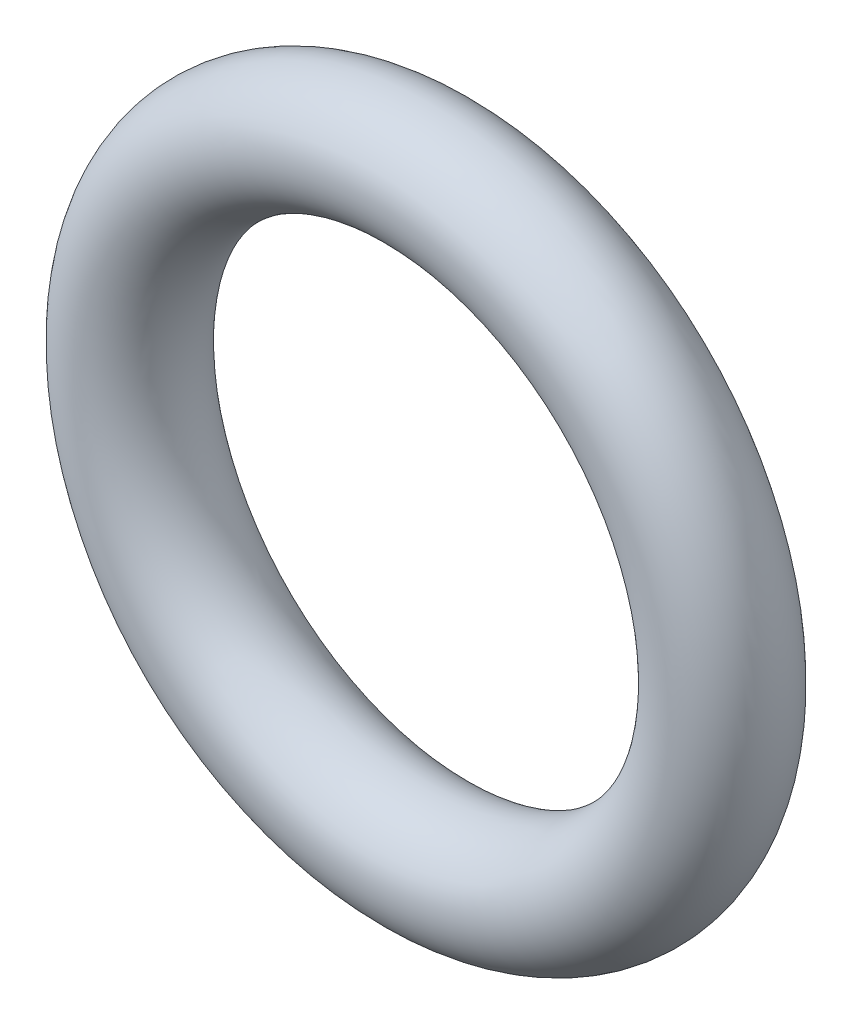
ISO-10303-21;
HEADER;
FILE_DESCRIPTION(('STEP AP214'),'2;1');
FILE_NAME('part.step','',(''),(''),'','','');
FILE_SCHEMA(('AUTOMOTIVE_DESIGN { 1 0 10303 214 1 1 1 1 }'));
ENDSEC;
DATA;
#1=APPLICATION_CONTEXT('core data for automotive mechanical design processes');
#2=APPLICATION_PROTOCOL_DEFINITION('international standard','automotive_design',2000,#1);
#3=PRODUCT_CONTEXT('',#1,'mechanical');
#4=PRODUCT('Part','Part','',(#3));
#5=PRODUCT_RELATED_PRODUCT_CATEGORY('part','',(#4));
#6=PRODUCT_DEFINITION_FORMATION('','',#4);
#7=PRODUCT_DEFINITION_CONTEXT('part definition',#1,'design');
#8=PRODUCT_DEFINITION('design','',#6,#7);
#9=PRODUCT_DEFINITION_SHAPE('','',#8);
#10=(LENGTH_UNIT() NAMED_UNIT(*) SI_UNIT(.MILLI.,.METRE.));
#11=(NAMED_UNIT(*) PLANE_ANGLE_UNIT() SI_UNIT($,.RADIAN.));
#12=(NAMED_UNIT(*) SI_UNIT($,.STERADIAN.) SOLID_ANGLE_UNIT());
#13=UNCERTAINTY_MEASURE_WITH_UNIT(LENGTH_MEASURE(1.E-05),#10,'distance_accuracy_value','');
#14=(GEOMETRIC_REPRESENTATION_CONTEXT(3) GLOBAL_UNCERTAINTY_ASSIGNED_CONTEXT((#13)) GLOBAL_UNIT_ASSIGNED_CONTEXT((#10,
#11,#12)) REPRESENTATION_CONTEXT('',''));
#15=CARTESIAN_POINT('',(0.,0.,0.));
#16=DIRECTION('',(0.,0.,1.));
#17=DIRECTION('',(1.,0.,0.));
#18=AXIS2_PLACEMENT_3D('',#15,#16,#17);
#19=CARTESIAN_POINT('',(0.,-8.43359375,0.));
#20=DIRECTION('',(0.,0.,1.));
#21=DIRECTION('',(1.,0.,0.));
#22=AXIS2_PLACEMENT_3D('',#19,#20,#21);
#23=TOROIDAL_SURFACE('',#22,8.43359375,1.68671875);
#24=CARTESIAN_POINT('',(0.,0.,0.));
#25=DIRECTION('',(1.,0.,0.));
#26=DIRECTION('',(0.,0.,-1.));
#27=AXIS2_PLACEMENT_3D('',#24,#25,#26);
#28=CIRCLE('',#27,1.68671875);
#29=CARTESIAN_POINT('',(0.,1.68671875,0.));
#30=VERTEX_POINT('',#29);
#31=EDGE_CURVE('E12',#30,#30,#28,.T.);
#32=CARTESIAN_POINT('',(0.,-8.43359375,0.));
#33=DIRECTION('',(0.,0.,1.));
#34=DIRECTION('',(1.,0.,0.));
#35=AXIS2_PLACEMENT_3D('',#32,#33,#34);
#36=CIRCLE('',#35,10.1203125);
#37=EDGE_CURVE('',#30,#30,#36,.T.);
#38=ORIENTED_EDGE('',*,*,#31,.F.);
#39=ORIENTED_EDGE('',*,*,#31,.T.);
#40=ORIENTED_EDGE('',*,*,#37,.T.);
#41=ORIENTED_EDGE('',*,*,#37,.F.);
#42=EDGE_LOOP('',(#38,#40,#39,#41));
#43=FACE_BOUND('',#42,.T.);
#44=ADVANCED_FACE('F45',(#43),#23,.T.);
#45=CLOSED_SHELL('',(#44));
#46=MANIFOLD_SOLID_BREP('B2',#45);
#47=ADVANCED_BREP_SHAPE_REPRESENTATION('',(#18,#46),#14);
#48=SHAPE_DEFINITION_REPRESENTATION(#9,#47);
ENDSEC;
END-ISO-10303-21;
